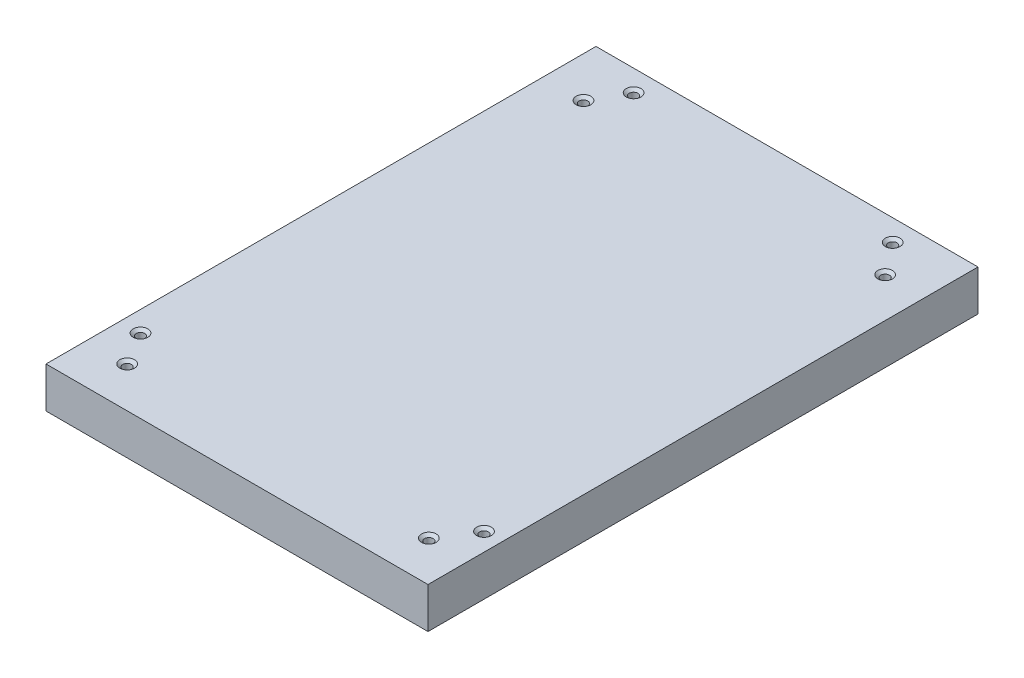
ISO-10303-21;
HEADER;
FILE_DESCRIPTION(('STEP AP214'),'2;1');
FILE_NAME('part.step','',(''),(''),'','','');
FILE_SCHEMA(('AUTOMOTIVE_DESIGN { 1 0 10303 214 1 1 1 1 }'));
ENDSEC;
DATA;
#1=APPLICATION_CONTEXT('core data for automotive mechanical design processes');
#2=APPLICATION_PROTOCOL_DEFINITION('international standard','automotive_design',2000,#1);
#3=PRODUCT_CONTEXT('',#1,'mechanical');
#4=PRODUCT('Part','Part','',(#3));
#5=PRODUCT_RELATED_PRODUCT_CATEGORY('part','',(#4));
#6=PRODUCT_DEFINITION_FORMATION('','',#4);
#7=PRODUCT_DEFINITION_CONTEXT('part definition',#1,'design');
#8=PRODUCT_DEFINITION('design','',#6,#7);
#9=PRODUCT_DEFINITION_SHAPE('','',#8);
#10=(LENGTH_UNIT() NAMED_UNIT(*) SI_UNIT(.MILLI.,.METRE.));
#11=(NAMED_UNIT(*) PLANE_ANGLE_UNIT() SI_UNIT($,.RADIAN.));
#12=(NAMED_UNIT(*) SI_UNIT($,.STERADIAN.) SOLID_ANGLE_UNIT());
#13=UNCERTAINTY_MEASURE_WITH_UNIT(LENGTH_MEASURE(1.E-05),#10,'distance_accuracy_value','');
#14=(GEOMETRIC_REPRESENTATION_CONTEXT(3) GLOBAL_UNCERTAINTY_ASSIGNED_CONTEXT((#13)) GLOBAL_UNIT_ASSIGNED_CONTEXT((#10,
#11,#12)) REPRESENTATION_CONTEXT('',''));
#15=CARTESIAN_POINT('',(0.,0.,0.));
#16=DIRECTION('',(0.,0.,1.));
#17=DIRECTION('',(1.,0.,0.));
#18=AXIS2_PLACEMENT_3D('',#15,#16,#17);
#19=CARTESIAN_POINT('',(-39.268627150472,8.382,56.5409180399653));
#20=DIRECTION('',(1.,0.,0.));
#21=DIRECTION('',(0.,0.,-1.));
#22=AXIS2_PLACEMENT_3D('',#19,#20,#21);
#23=PLANE('',#22);
#24=DIRECTION('',(0.,0.,1.));
#25=VECTOR('',#24,1.);
#26=CARTESIAN_POINT('',(-39.268627150472,0.,56.5409180399653));
#27=LINE('',#26,#25);
#28=CARTESIAN_POINT('',(-39.268627150472,0.,-56.5409180399653));
#29=VERTEX_POINT('',#28);
#30=CARTESIAN_POINT('',(-39.268627150472,0.,56.5409180399653));
#31=VERTEX_POINT('',#30);
#32=EDGE_CURVE('E100',#29,#31,#27,.T.);
#33=ORIENTED_EDGE('',*,*,#32,.T.);
#34=DIRECTION('',(0.,-1.,0.));
#35=VECTOR('',#34,1.);
#36=CARTESIAN_POINT('',(-39.268627150472,8.382,56.5409180399653));
#37=LINE('',#36,#35);
#38=CARTESIAN_POINT('',(-39.268627150472,8.382,56.5409180399653));
#39=VERTEX_POINT('',#38);
#40=EDGE_CURVE('E11',#39,#31,#37,.T.);
#41=ORIENTED_EDGE('',*,*,#40,.F.);
#42=DIRECTION('',(0.,0.,1.));
#43=VECTOR('',#42,1.);
#44=CARTESIAN_POINT('',(-39.268627150472,8.382,56.5409180399653));
#45=LINE('',#44,#43);
#46=CARTESIAN_POINT('',(-39.268627150472,8.382,-56.5409180399653));
#47=VERTEX_POINT('',#46);
#48=EDGE_CURVE('E88',#47,#39,#45,.T.);
#49=ORIENTED_EDGE('',*,*,#48,.F.);
#50=DIRECTION('',(0.,-1.,0.));
#51=VECTOR('',#50,1.);
#52=CARTESIAN_POINT('',(-39.268627150472,8.382,-56.5409180399653));
#53=LINE('',#52,#51);
#54=EDGE_CURVE('E96',#47,#29,#53,.T.);
#55=ORIENTED_EDGE('',*,*,#54,.T.);
#56=EDGE_LOOP('',(#33,#41,#49,#55));
#57=FACE_BOUND('',#56,.T.);
#58=ADVANCED_FACE('F37',(#57),#23,.F.);
#59=CARTESIAN_POINT('',(39.268627150472,8.382,56.5409180399653));
#60=DIRECTION('',(0.,0.,-1.));
#61=DIRECTION('',(-1.,0.,0.));
#62=AXIS2_PLACEMENT_3D('',#59,#60,#61);
#63=PLANE('',#62);
#64=DIRECTION('',(1.,0.,0.));
#65=VECTOR('',#64,1.);
#66=CARTESIAN_POINT('',(39.268627150472,0.,56.5409180399653));
#67=LINE('',#66,#65);
#68=CARTESIAN_POINT('',(39.268627150472,0.,56.5409180399653));
#69=VERTEX_POINT('',#68);
#70=EDGE_CURVE('E92',#31,#69,#67,.T.);
#71=ORIENTED_EDGE('',*,*,#70,.T.);
#72=DIRECTION('',(0.,-1.,0.));
#73=VECTOR('',#72,1.);
#74=CARTESIAN_POINT('',(39.268627150472,8.382,56.5409180399653));
#75=LINE('',#74,#73);
#76=CARTESIAN_POINT('',(39.268627150472,8.382,56.5409180399653));
#77=VERTEX_POINT('',#76);
#78=EDGE_CURVE('E45',#77,#69,#75,.T.);
#79=ORIENTED_EDGE('',*,*,#78,.F.);
#80=DIRECTION('',(1.,0.,0.));
#81=VECTOR('',#80,1.);
#82=CARTESIAN_POINT('',(39.268627150472,8.382,56.5409180399653));
#83=LINE('',#82,#81);
#84=EDGE_CURVE('E83',#39,#77,#83,.T.);
#85=ORIENTED_EDGE('',*,*,#84,.F.);
#86=ORIENTED_EDGE('',*,*,#40,.T.);
#87=EDGE_LOOP('',(#71,#79,#85,#86));
#88=FACE_BOUND('',#87,.T.);
#89=ADVANCED_FACE('F91',(#88),#63,.F.);
#90=CARTESIAN_POINT('',(39.268627150472,8.382,56.5409180399653));
#91=DIRECTION('',(-1.,0.,0.));
#92=DIRECTION('',(0.,0.,1.));
#93=AXIS2_PLACEMENT_3D('',#90,#91,#92);
#94=PLANE('',#93);
#95=DIRECTION('',(0.,0.,-1.));
#96=VECTOR('',#95,1.);
#97=CARTESIAN_POINT('',(39.268627150472,0.,56.5409180399653));
#98=LINE('',#97,#96);
#99=CARTESIAN_POINT('',(39.268627150472,0.,-56.5409180399653));
#100=VERTEX_POINT('',#99);
#101=EDGE_CURVE('E70',#69,#100,#98,.T.);
#102=ORIENTED_EDGE('',*,*,#101,.T.);
#103=DIRECTION('',(0.,-1.,0.));
#104=VECTOR('',#103,1.);
#105=CARTESIAN_POINT('',(39.268627150472,8.382,-56.5409180399653));
#106=LINE('',#105,#104);
#107=CARTESIAN_POINT('',(39.268627150472,8.382,-56.5409180399653));
#108=VERTEX_POINT('',#107);
#109=EDGE_CURVE('E93',#108,#100,#106,.T.);
#110=ORIENTED_EDGE('',*,*,#109,.F.);
#111=DIRECTION('',(0.,0.,-1.));
#112=VECTOR('',#111,1.);
#113=CARTESIAN_POINT('',(39.268627150472,8.382,56.5409180399653));
#114=LINE('',#113,#112);
#115=EDGE_CURVE('E86',#77,#108,#114,.T.);
#116=ORIENTED_EDGE('',*,*,#115,.F.);
#117=ORIENTED_EDGE('',*,*,#78,.T.);
#118=EDGE_LOOP('',(#102,#110,#116,#117));
#119=FACE_BOUND('',#118,.T.);
#120=ADVANCED_FACE('F94',(#119),#94,.F.);
#121=CARTESIAN_POINT('',(39.268627150472,8.382,-56.5409180399653));
#122=DIRECTION('',(0.,0.,1.));
#123=DIRECTION('',(1.,0.,0.));
#124=AXIS2_PLACEMENT_3D('',#121,#122,#123);
#125=PLANE('',#124);
#126=DIRECTION('',(-1.,0.,0.));
#127=VECTOR('',#126,1.);
#128=CARTESIAN_POINT('',(39.268627150472,0.,-56.5409180399653));
#129=LINE('',#128,#127);
#130=EDGE_CURVE('E76',#100,#29,#129,.T.);
#131=ORIENTED_EDGE('',*,*,#130,.T.);
#132=ORIENTED_EDGE('',*,*,#54,.F.);
#133=DIRECTION('',(-1.,0.,0.));
#134=VECTOR('',#133,1.);
#135=CARTESIAN_POINT('',(39.268627150472,8.382,-56.5409180399653));
#136=LINE('',#135,#134);
#137=EDGE_CURVE('E53',#108,#47,#136,.T.);
#138=ORIENTED_EDGE('',*,*,#137,.F.);
#139=ORIENTED_EDGE('',*,*,#109,.T.);
#140=EDGE_LOOP('',(#131,#132,#138,#139));
#141=FACE_BOUND('',#140,.T.);
#142=ADVANCED_FACE('F108',(#141),#125,.F.);
#143=CARTESIAN_POINT('',(0.,8.382,0.));
#144=DIRECTION('',(0.,1.,0.));
#145=DIRECTION('',(0.,0.,1.));
#146=AXIS2_PLACEMENT_3D('',#143,#144,#145);
#147=PLANE('',#146);
#148=CARTESIAN_POINT('',(-30.9288863091976,8.382,-45.6201073060665));
#149=DIRECTION('',(0.,1.,0.));
#150=DIRECTION('',(0.,0.,1.));
#151=AXIS2_PLACEMENT_3D('',#148,#149,#150);
#152=CIRCLE('',#151,1.5113);
#153=CARTESIAN_POINT('',(-30.9288863091976,8.382,-44.1088073060665));
#154=VERTEX_POINT('',#153);
#155=EDGE_CURVE('E182',#154,#154,#152,.T.);
#156=ORIENTED_EDGE('',*,*,#155,.F.);
#157=EDGE_LOOP('',(#156));
#158=FACE_BOUND('',#157,.T.);
#159=CARTESIAN_POINT('',(31.1007134553598,8.382,-45.6201073060665));
#160=DIRECTION('',(0.,1.,0.));
#161=DIRECTION('',(0.,0.,1.));
#162=AXIS2_PLACEMENT_3D('',#159,#160,#161);
#163=CIRCLE('',#162,1.5113);
#164=CARTESIAN_POINT('',(31.1007134553598,8.382,-44.1088073060665));
#165=VERTEX_POINT('',#164);
#166=EDGE_CURVE('E173',#165,#165,#163,.T.);
#167=ORIENTED_EDGE('',*,*,#166,.F.);
#168=EDGE_LOOP('',(#167));
#169=FACE_BOUND('',#168,.T.);
#170=CARTESIAN_POINT('',(31.1007134553598,8.382,48.1975144984996));
#171=DIRECTION('',(0.,1.,0.));
#172=DIRECTION('',(0.,0.,1.));
#173=AXIS2_PLACEMENT_3D('',#170,#171,#172);
#174=CIRCLE('',#173,1.5113);
#175=CARTESIAN_POINT('',(31.1007134553598,8.382,49.7088144984996));
#176=VERTEX_POINT('',#175);
#177=EDGE_CURVE('E164',#176,#176,#174,.T.);
#178=ORIENTED_EDGE('',*,*,#177,.F.);
#179=EDGE_LOOP('',(#178));
#180=FACE_BOUND('',#179,.T.);
#181=CARTESIAN_POINT('',(-30.9288863091976,8.382,48.1975144984996));
#182=DIRECTION('',(0.,1.,0.));
#183=DIRECTION('',(0.,0.,1.));
#184=AXIS2_PLACEMENT_3D('',#181,#182,#183);
#185=CIRCLE('',#184,1.5113);
#186=CARTESIAN_POINT('',(-30.9288863091976,8.382,49.7088144984996));
#187=VERTEX_POINT('',#186);
#188=EDGE_CURVE('E155',#187,#187,#185,.T.);
#189=ORIENTED_EDGE('',*,*,#188,.F.);
#190=EDGE_LOOP('',(#189));
#191=FACE_BOUND('',#190,.T.);
#192=CARTESIAN_POINT('',(-35.0527378170906,8.382,41.3244286520112));
#193=DIRECTION('',(0.,1.,0.));
#194=DIRECTION('',(0.,0.,1.));
#195=AXIS2_PLACEMENT_3D('',#192,#193,#194);
#196=CIRCLE('',#195,1.5113);
#197=CARTESIAN_POINT('',(-35.0527378170906,8.382,42.8357286520112));
#198=VERTEX_POINT('',#197);
#199=EDGE_CURVE('E146',#198,#198,#196,.T.);
#200=ORIENTED_EDGE('',*,*,#199,.F.);
#201=EDGE_LOOP('',(#200));
#202=FACE_BOUND('',#201,.T.);
#203=CARTESIAN_POINT('',(35.5682192555773,8.382,41.3244286520112));
#204=DIRECTION('',(0.,1.,0.));
#205=DIRECTION('',(0.,0.,1.));
#206=AXIS2_PLACEMENT_3D('',#203,#204,#205);
#207=CIRCLE('',#206,1.5113);
#208=CARTESIAN_POINT('',(35.5682192555773,8.382,42.8357286520112));
#209=VERTEX_POINT('',#208);
#210=EDGE_CURVE('E137',#209,#209,#207,.T.);
#211=ORIENTED_EDGE('',*,*,#210,.F.);
#212=EDGE_LOOP('',(#211));
#213=FACE_BOUND('',#212,.T.);
#214=CARTESIAN_POINT('',(26.1177262166558,8.382,-52.1495388602305));
#215=DIRECTION('',(0.,1.,0.));
#216=DIRECTION('',(0.,0.,1.));
#217=AXIS2_PLACEMENT_3D('',#214,#215,#216);
#218=CIRCLE('',#217,1.5113);
#219=CARTESIAN_POINT('',(26.1177262166558,8.382,-50.6382388602305));
#220=VERTEX_POINT('',#219);
#221=EDGE_CURVE('E128',#220,#220,#218,.T.);
#222=ORIENTED_EDGE('',*,*,#221,.F.);
#223=EDGE_LOOP('',(#222));
#224=FACE_BOUND('',#223,.T.);
#225=CARTESIAN_POINT('',(-27.148689093629,8.382,-52.1495388602305));
#226=DIRECTION('',(0.,1.,0.));
#227=DIRECTION('',(0.,0.,1.));
#228=AXIS2_PLACEMENT_3D('',#225,#226,#227);
#229=CIRCLE('',#228,1.5113);
#230=CARTESIAN_POINT('',(-27.148689093629,8.382,-50.6382388602305));
#231=VERTEX_POINT('',#230);
#232=EDGE_CURVE('E119',#231,#231,#229,.T.);
#233=ORIENTED_EDGE('',*,*,#232,.F.);
#234=EDGE_LOOP('',(#233));
#235=FACE_BOUND('',#234,.T.);
#236=ORIENTED_EDGE('',*,*,#48,.T.);
#237=ORIENTED_EDGE('',*,*,#84,.T.);
#238=ORIENTED_EDGE('',*,*,#115,.T.);
#239=ORIENTED_EDGE('',*,*,#137,.T.);
#240=EDGE_LOOP('',(#236,#237,#238,#239));
#241=FACE_BOUND('',#240,.T.);
#242=ADVANCED_FACE('F84',(#158,#169,#180,#191,#202,#213,#224,#235,#241),#147,.T.);
#243=CARTESIAN_POINT('',(0.,0.,0.));
#244=DIRECTION('',(0.,1.,0.));
#245=DIRECTION('',(0.,0.,1.));
#246=AXIS2_PLACEMENT_3D('',#243,#244,#245);
#247=PLANE('',#246);
#248=CARTESIAN_POINT('',(-30.9288863091976,0.,-45.6201073060665));
#249=DIRECTION('',(0.,1.,0.));
#250=DIRECTION('',(0.,0.,1.));
#251=AXIS2_PLACEMENT_3D('',#248,#249,#250);
#252=CIRCLE('',#251,0.888999999999997);
#253=CARTESIAN_POINT('',(-30.9288863091976,0.,-44.7311073060665));
#254=VERTEX_POINT('',#253);
#255=EDGE_CURVE('E176',#254,#254,#252,.T.);
#256=ORIENTED_EDGE('',*,*,#255,.T.);
#257=EDGE_LOOP('',(#256));
#258=FACE_BOUND('',#257,.T.);
#259=CARTESIAN_POINT('',(31.1007134553598,0.,-45.6201073060665));
#260=DIRECTION('',(0.,1.,0.));
#261=DIRECTION('',(0.,0.,1.));
#262=AXIS2_PLACEMENT_3D('',#259,#260,#261);
#263=CIRCLE('',#262,0.889000000000001);
#264=CARTESIAN_POINT('',(31.1007134553598,0.,-44.7311073060665));
#265=VERTEX_POINT('',#264);
#266=EDGE_CURVE('E167',#265,#265,#263,.T.);
#267=ORIENTED_EDGE('',*,*,#266,.T.);
#268=EDGE_LOOP('',(#267));
#269=FACE_BOUND('',#268,.T.);
#270=CARTESIAN_POINT('',(31.1007134553598,0.,48.1975144984996));
#271=DIRECTION('',(0.,1.,0.));
#272=DIRECTION('',(0.,0.,1.));
#273=AXIS2_PLACEMENT_3D('',#270,#271,#272);
#274=CIRCLE('',#273,0.889000000000001);
#275=CARTESIAN_POINT('',(31.1007134553598,0.,49.0865144984996));
#276=VERTEX_POINT('',#275);
#277=EDGE_CURVE('E158',#276,#276,#274,.T.);
#278=ORIENTED_EDGE('',*,*,#277,.T.);
#279=EDGE_LOOP('',(#278));
#280=FACE_BOUND('',#279,.T.);
#281=CARTESIAN_POINT('',(-30.9288863091976,0.,48.1975144984996));
#282=DIRECTION('',(0.,1.,0.));
#283=DIRECTION('',(0.,0.,1.));
#284=AXIS2_PLACEMENT_3D('',#281,#282,#283);
#285=CIRCLE('',#284,0.888999999999997);
#286=CARTESIAN_POINT('',(-30.9288863091976,0.,49.0865144984996));
#287=VERTEX_POINT('',#286);
#288=EDGE_CURVE('E149',#287,#287,#285,.T.);
#289=ORIENTED_EDGE('',*,*,#288,.T.);
#290=EDGE_LOOP('',(#289));
#291=FACE_BOUND('',#290,.T.);
#292=CARTESIAN_POINT('',(-35.0527378170906,0.,41.3244286520112));
#293=DIRECTION('',(0.,1.,0.));
#294=DIRECTION('',(0.,0.,1.));
#295=AXIS2_PLACEMENT_3D('',#292,#293,#294);
#296=CIRCLE('',#295,0.889000000000001);
#297=CARTESIAN_POINT('',(-35.0527378170906,0.,42.2134286520112));
#298=VERTEX_POINT('',#297);
#299=EDGE_CURVE('E140',#298,#298,#296,.T.);
#300=ORIENTED_EDGE('',*,*,#299,.T.);
#301=EDGE_LOOP('',(#300));
#302=FACE_BOUND('',#301,.T.);
#303=CARTESIAN_POINT('',(35.5682192555773,0.,41.3244286520112));
#304=DIRECTION('',(0.,1.,0.));
#305=DIRECTION('',(0.,0.,1.));
#306=AXIS2_PLACEMENT_3D('',#303,#304,#305);
#307=CIRCLE('',#306,0.889000000000001);
#308=CARTESIAN_POINT('',(35.5682192555773,0.,42.2134286520112));
#309=VERTEX_POINT('',#308);
#310=EDGE_CURVE('E131',#309,#309,#307,.T.);
#311=ORIENTED_EDGE('',*,*,#310,.T.);
#312=EDGE_LOOP('',(#311));
#313=FACE_BOUND('',#312,.T.);
#314=CARTESIAN_POINT('',(26.1177262166558,0.,-52.1495388602305));
#315=DIRECTION('',(0.,1.,0.));
#316=DIRECTION('',(0.,0.,1.));
#317=AXIS2_PLACEMENT_3D('',#314,#315,#316);
#318=CIRCLE('',#317,0.888999999999997);
#319=CARTESIAN_POINT('',(26.1177262166558,0.,-51.2605388602305));
#320=VERTEX_POINT('',#319);
#321=EDGE_CURVE('E122',#320,#320,#318,.T.);
#322=ORIENTED_EDGE('',*,*,#321,.T.);
#323=EDGE_LOOP('',(#322));
#324=FACE_BOUND('',#323,.T.);
#325=CARTESIAN_POINT('',(-27.148689093629,0.,-52.1495388602305));
#326=DIRECTION('',(0.,1.,0.));
#327=DIRECTION('',(0.,0.,1.));
#328=AXIS2_PLACEMENT_3D('',#325,#326,#327);
#329=CIRCLE('',#328,0.888999999999997);
#330=CARTESIAN_POINT('',(-27.148689093629,0.,-51.2605388602305));
#331=VERTEX_POINT('',#330);
#332=EDGE_CURVE('E103',#331,#331,#329,.T.);
#333=ORIENTED_EDGE('',*,*,#332,.T.);
#334=EDGE_LOOP('',(#333));
#335=FACE_BOUND('',#334,.T.);
#336=ORIENTED_EDGE('',*,*,#32,.F.);
#337=ORIENTED_EDGE('',*,*,#130,.F.);
#338=ORIENTED_EDGE('',*,*,#101,.F.);
#339=ORIENTED_EDGE('',*,*,#70,.F.);
#340=EDGE_LOOP('',(#336,#337,#338,#339));
#341=FACE_BOUND('',#340,.T.);
#342=ADVANCED_FACE('F111',(#258,#269,#280,#291,#302,#313,#324,#335,#341),#247,.F.);
#343=CARTESIAN_POINT('',(-27.148689093629,8.382,-52.1495388602305));
#344=DIRECTION('',(0.,1.,0.));
#345=DIRECTION('',(0.,0.,1.));
#346=AXIS2_PLACEMENT_3D('',#343,#344,#345);
#347=CYLINDRICAL_SURFACE('',#346,0.888999999999999);
#348=ORIENTED_EDGE('',*,*,#332,.F.);
#349=EDGE_LOOP('',(#348));
#350=FACE_BOUND('',#349,.T.);
#351=CARTESIAN_POINT('',(-27.148689093629,7.85982829951838,-52.1495388602305));
#352=DIRECTION('',(0.,1.,0.));
#353=DIRECTION('',(0.,0.,1.));
#354=AXIS2_PLACEMENT_3D('',#351,#352,#353);
#355=CIRCLE('',#354,0.889000000000001);
#356=CARTESIAN_POINT('',(-27.148689093629,7.85982829951838,-51.2605388602305));
#357=VERTEX_POINT('',#356);
#358=EDGE_CURVE('E116',#357,#357,#355,.T.);
#359=ORIENTED_EDGE('',*,*,#358,.T.);
#360=EDGE_LOOP('',(#359));
#361=FACE_BOUND('',#360,.T.);
#362=ADVANCED_FACE('F208',(#350,#361),#347,.F.);
#363=CARTESIAN_POINT('',(-27.148689093629,8.382,-52.1495388602305));
#364=DIRECTION('',(0.,1.,0.));
#365=DIRECTION('',(0.,0.,1.));
#366=AXIS2_PLACEMENT_3D('',#363,#364,#365);
#367=CONICAL_SURFACE('',#366,1.5113,0.872664625997165);
#368=ORIENTED_EDGE('',*,*,#358,.F.);
#369=EDGE_LOOP('',(#368));
#370=FACE_BOUND('',#369,.T.);
#371=ORIENTED_EDGE('',*,*,#232,.T.);
#372=EDGE_LOOP('',(#371));
#373=FACE_BOUND('',#372,.T.);
#374=ADVANCED_FACE('F205',(#370,#373),#367,.F.);
#375=CARTESIAN_POINT('',(26.1177262166558,8.382,-52.1495388602305));
#376=DIRECTION('',(0.,1.,0.));
#377=DIRECTION('',(0.,0.,1.));
#378=AXIS2_PLACEMENT_3D('',#375,#376,#377);
#379=CYLINDRICAL_SURFACE('',#378,0.888999999999999);
#380=ORIENTED_EDGE('',*,*,#321,.F.);
#381=EDGE_LOOP('',(#380));
#382=FACE_BOUND('',#381,.T.);
#383=CARTESIAN_POINT('',(26.1177262166558,7.85982829951838,-52.1495388602305));
#384=DIRECTION('',(0.,1.,0.));
#385=DIRECTION('',(0.,0.,1.));
#386=AXIS2_PLACEMENT_3D('',#383,#384,#385);
#387=CIRCLE('',#386,0.889000000000001);
#388=CARTESIAN_POINT('',(26.1177262166558,7.85982829951838,-51.2605388602305));
#389=VERTEX_POINT('',#388);
#390=EDGE_CURVE('E125',#389,#389,#387,.T.);
#391=ORIENTED_EDGE('',*,*,#390,.T.);
#392=EDGE_LOOP('',(#391));
#393=FACE_BOUND('',#392,.T.);
#394=ADVANCED_FACE('F207',(#382,#393),#379,.F.);
#395=CARTESIAN_POINT('',(26.1177262166558,8.382,-52.1495388602305));
#396=DIRECTION('',(0.,1.,0.));
#397=DIRECTION('',(0.,0.,1.));
#398=AXIS2_PLACEMENT_3D('',#395,#396,#397);
#399=CONICAL_SURFACE('',#398,1.5113,0.872664625997165);
#400=ORIENTED_EDGE('',*,*,#390,.F.);
#401=EDGE_LOOP('',(#400));
#402=FACE_BOUND('',#401,.T.);
#403=ORIENTED_EDGE('',*,*,#221,.T.);
#404=EDGE_LOOP('',(#403));
#405=FACE_BOUND('',#404,.T.);
#406=ADVANCED_FACE('F215',(#402,#405),#399,.F.);
#407=CARTESIAN_POINT('',(35.5682192555773,8.382,41.3244286520112));
#408=DIRECTION('',(0.,1.,0.));
#409=DIRECTION('',(0.,0.,1.));
#410=AXIS2_PLACEMENT_3D('',#407,#408,#409);
#411=CYLINDRICAL_SURFACE('',#410,0.889000000000001);
#412=ORIENTED_EDGE('',*,*,#310,.F.);
#413=EDGE_LOOP('',(#412));
#414=FACE_BOUND('',#413,.T.);
#415=CARTESIAN_POINT('',(35.5682192555773,7.85982829951838,41.3244286520112));
#416=DIRECTION('',(0.,1.,0.));
#417=DIRECTION('',(0.,0.,1.));
#418=AXIS2_PLACEMENT_3D('',#415,#416,#417);
#419=CIRCLE('',#418,0.889000000000001);
#420=CARTESIAN_POINT('',(35.5682192555773,7.85982829951838,42.2134286520112));
#421=VERTEX_POINT('',#420);
#422=EDGE_CURVE('E134',#421,#421,#419,.T.);
#423=ORIENTED_EDGE('',*,*,#422,.T.);
#424=EDGE_LOOP('',(#423));
#425=FACE_BOUND('',#424,.T.);
#426=ADVANCED_FACE('F257',(#414,#425),#411,.F.);
#427=CARTESIAN_POINT('',(35.5682192555773,8.382,41.3244286520112));
#428=DIRECTION('',(0.,1.,0.));
#429=DIRECTION('',(0.,0.,1.));
#430=AXIS2_PLACEMENT_3D('',#427,#428,#429);
#431=CONICAL_SURFACE('',#430,1.5113,0.872664625997165);
#432=ORIENTED_EDGE('',*,*,#422,.F.);
#433=EDGE_LOOP('',(#432));
#434=FACE_BOUND('',#433,.T.);
#435=ORIENTED_EDGE('',*,*,#210,.T.);
#436=EDGE_LOOP('',(#435));
#437=FACE_BOUND('',#436,.T.);
#438=ADVANCED_FACE('F262',(#434,#437),#431,.F.);
#439=CARTESIAN_POINT('',(-35.0527378170906,8.382,41.3244286520112));
#440=DIRECTION('',(0.,1.,0.));
#441=DIRECTION('',(0.,0.,1.));
#442=AXIS2_PLACEMENT_3D('',#439,#440,#441);
#443=CYLINDRICAL_SURFACE('',#442,0.889000000000001);
#444=ORIENTED_EDGE('',*,*,#299,.F.);
#445=EDGE_LOOP('',(#444));
#446=FACE_BOUND('',#445,.T.);
#447=CARTESIAN_POINT('',(-35.0527378170906,7.85982829951838,41.3244286520112));
#448=DIRECTION('',(0.,1.,0.));
#449=DIRECTION('',(0.,0.,1.));
#450=AXIS2_PLACEMENT_3D('',#447,#448,#449);
#451=CIRCLE('',#450,0.889000000000001);
#452=CARTESIAN_POINT('',(-35.0527378170906,7.85982829951838,42.2134286520112));
#453=VERTEX_POINT('',#452);
#454=EDGE_CURVE('E143',#453,#453,#451,.T.);
#455=ORIENTED_EDGE('',*,*,#454,.T.);
#456=EDGE_LOOP('',(#455));
#457=FACE_BOUND('',#456,.T.);
#458=ADVANCED_FACE('F268',(#446,#457),#443,.F.);
#459=CARTESIAN_POINT('',(-35.0527378170906,8.382,41.3244286520112));
#460=DIRECTION('',(0.,1.,0.));
#461=DIRECTION('',(0.,0.,1.));
#462=AXIS2_PLACEMENT_3D('',#459,#460,#461);
#463=CONICAL_SURFACE('',#462,1.5113,0.872664625997165);
#464=ORIENTED_EDGE('',*,*,#454,.F.);
#465=EDGE_LOOP('',(#464));
#466=FACE_BOUND('',#465,.T.);
#467=ORIENTED_EDGE('',*,*,#199,.T.);
#468=EDGE_LOOP('',(#467));
#469=FACE_BOUND('',#468,.T.);
#470=ADVANCED_FACE('F272',(#466,#469),#463,.F.);
#471=CARTESIAN_POINT('',(-30.9288863091976,8.382,48.1975144984996));
#472=DIRECTION('',(0.,1.,0.));
#473=DIRECTION('',(0.,0.,1.));
#474=AXIS2_PLACEMENT_3D('',#471,#472,#473);
#475=CYLINDRICAL_SURFACE('',#474,0.888999999999999);
#476=ORIENTED_EDGE('',*,*,#288,.F.);
#477=EDGE_LOOP('',(#476));
#478=FACE_BOUND('',#477,.T.);
#479=CARTESIAN_POINT('',(-30.9288863091976,7.85982829951838,48.1975144984996));
#480=DIRECTION('',(0.,1.,0.));
#481=DIRECTION('',(0.,0.,1.));
#482=AXIS2_PLACEMENT_3D('',#479,#480,#481);
#483=CIRCLE('',#482,0.889000000000001);
#484=CARTESIAN_POINT('',(-30.9288863091976,7.85982829951838,49.0865144984996));
#485=VERTEX_POINT('',#484);
#486=EDGE_CURVE('E152',#485,#485,#483,.T.);
#487=ORIENTED_EDGE('',*,*,#486,.T.);
#488=EDGE_LOOP('',(#487));
#489=FACE_BOUND('',#488,.T.);
#490=ADVANCED_FACE('F276',(#478,#489),#475,.F.);
#491=CARTESIAN_POINT('',(-30.9288863091976,8.382,48.1975144984996));
#492=DIRECTION('',(0.,1.,0.));
#493=DIRECTION('',(0.,0.,1.));
#494=AXIS2_PLACEMENT_3D('',#491,#492,#493);
#495=CONICAL_SURFACE('',#494,1.5113,0.872664625997165);
#496=ORIENTED_EDGE('',*,*,#486,.F.);
#497=EDGE_LOOP('',(#496));
#498=FACE_BOUND('',#497,.T.);
#499=ORIENTED_EDGE('',*,*,#188,.T.);
#500=EDGE_LOOP('',(#499));
#501=FACE_BOUND('',#500,.T.);
#502=ADVANCED_FACE('F280',(#498,#501),#495,.F.);
#503=CARTESIAN_POINT('',(31.1007134553598,8.382,48.1975144984996));
#504=DIRECTION('',(0.,1.,0.));
#505=DIRECTION('',(0.,0.,1.));
#506=AXIS2_PLACEMENT_3D('',#503,#504,#505);
#507=CYLINDRICAL_SURFACE('',#506,0.889000000000001);
#508=ORIENTED_EDGE('',*,*,#277,.F.);
#509=EDGE_LOOP('',(#508));
#510=FACE_BOUND('',#509,.T.);
#511=CARTESIAN_POINT('',(31.1007134553598,7.85982829951838,48.1975144984996));
#512=DIRECTION('',(0.,1.,0.));
#513=DIRECTION('',(0.,0.,1.));
#514=AXIS2_PLACEMENT_3D('',#511,#512,#513);
#515=CIRCLE('',#514,0.889000000000001);
#516=CARTESIAN_POINT('',(31.1007134553598,7.85982829951838,49.0865144984996));
#517=VERTEX_POINT('',#516);
#518=EDGE_CURVE('E161',#517,#517,#515,.T.);
#519=ORIENTED_EDGE('',*,*,#518,.T.);
#520=EDGE_LOOP('',(#519));
#521=FACE_BOUND('',#520,.T.);
#522=ADVANCED_FACE('F284',(#510,#521),#507,.F.);
#523=CARTESIAN_POINT('',(31.1007134553598,8.382,48.1975144984996));
#524=DIRECTION('',(0.,1.,0.));
#525=DIRECTION('',(0.,0.,1.));
#526=AXIS2_PLACEMENT_3D('',#523,#524,#525);
#527=CONICAL_SURFACE('',#526,1.5113,0.872664625997165);
#528=ORIENTED_EDGE('',*,*,#518,.F.);
#529=EDGE_LOOP('',(#528));
#530=FACE_BOUND('',#529,.T.);
#531=ORIENTED_EDGE('',*,*,#177,.T.);
#532=EDGE_LOOP('',(#531));
#533=FACE_BOUND('',#532,.T.);
#534=ADVANCED_FACE('F288',(#530,#533),#527,.F.);
#535=CARTESIAN_POINT('',(31.1007134553598,8.382,-45.6201073060665));
#536=DIRECTION('',(0.,1.,0.));
#537=DIRECTION('',(0.,0.,1.));
#538=AXIS2_PLACEMENT_3D('',#535,#536,#537);
#539=CYLINDRICAL_SURFACE('',#538,0.889000000000001);
#540=ORIENTED_EDGE('',*,*,#266,.F.);
#541=EDGE_LOOP('',(#540));
#542=FACE_BOUND('',#541,.T.);
#543=CARTESIAN_POINT('',(31.1007134553598,7.85982829951838,-45.6201073060665));
#544=DIRECTION('',(0.,1.,0.));
#545=DIRECTION('',(0.,0.,1.));
#546=AXIS2_PLACEMENT_3D('',#543,#544,#545);
#547=CIRCLE('',#546,0.889000000000001);
#548=CARTESIAN_POINT('',(31.1007134553598,7.85982829951838,-44.7311073060665));
#549=VERTEX_POINT('',#548);
#550=EDGE_CURVE('E170',#549,#549,#547,.T.);
#551=ORIENTED_EDGE('',*,*,#550,.T.);
#552=EDGE_LOOP('',(#551));
#553=FACE_BOUND('',#552,.T.);
#554=ADVANCED_FACE('F292',(#542,#553),#539,.F.);
#555=CARTESIAN_POINT('',(31.1007134553598,8.382,-45.6201073060665));
#556=DIRECTION('',(0.,1.,0.));
#557=DIRECTION('',(0.,0.,1.));
#558=AXIS2_PLACEMENT_3D('',#555,#556,#557);
#559=CONICAL_SURFACE('',#558,1.5113,0.872664625997165);
#560=ORIENTED_EDGE('',*,*,#550,.F.);
#561=EDGE_LOOP('',(#560));
#562=FACE_BOUND('',#561,.T.);
#563=ORIENTED_EDGE('',*,*,#166,.T.);
#564=EDGE_LOOP('',(#563));
#565=FACE_BOUND('',#564,.T.);
#566=ADVANCED_FACE('F296',(#562,#565),#559,.F.);
#567=CARTESIAN_POINT('',(-30.9288863091976,8.382,-45.6201073060665));
#568=DIRECTION('',(0.,1.,0.));
#569=DIRECTION('',(0.,0.,1.));
#570=AXIS2_PLACEMENT_3D('',#567,#568,#569);
#571=CYLINDRICAL_SURFACE('',#570,0.888999999999999);
#572=ORIENTED_EDGE('',*,*,#255,.F.);
#573=EDGE_LOOP('',(#572));
#574=FACE_BOUND('',#573,.T.);
#575=CARTESIAN_POINT('',(-30.9288863091976,7.85982829951838,-45.6201073060665));
#576=DIRECTION('',(0.,1.,0.));
#577=DIRECTION('',(0.,0.,1.));
#578=AXIS2_PLACEMENT_3D('',#575,#576,#577);
#579=CIRCLE('',#578,0.889000000000001);
#580=CARTESIAN_POINT('',(-30.9288863091976,7.85982829951838,-44.7311073060665));
#581=VERTEX_POINT('',#580);
#582=EDGE_CURVE('E179',#581,#581,#579,.T.);
#583=ORIENTED_EDGE('',*,*,#582,.T.);
#584=EDGE_LOOP('',(#583));
#585=FACE_BOUND('',#584,.T.);
#586=ADVANCED_FACE('F300',(#574,#585),#571,.F.);
#587=CARTESIAN_POINT('',(-30.9288863091976,8.382,-45.6201073060665));
#588=DIRECTION('',(0.,1.,0.));
#589=DIRECTION('',(0.,0.,1.));
#590=AXIS2_PLACEMENT_3D('',#587,#588,#589);
#591=CONICAL_SURFACE('',#590,1.5113,0.872664625997165);
#592=ORIENTED_EDGE('',*,*,#582,.F.);
#593=EDGE_LOOP('',(#592));
#594=FACE_BOUND('',#593,.T.);
#595=ORIENTED_EDGE('',*,*,#155,.T.);
#596=EDGE_LOOP('',(#595));
#597=FACE_BOUND('',#596,.T.);
#598=ADVANCED_FACE('F186',(#594,#597),#591,.F.);
#599=CLOSED_SHELL('',(#58,#89,#120,#142,#242,#342,#362,#374,#394,#406,#426,#438,#458,#470,#490,
#502,#522,#534,#554,#566,#586,#598));
#600=MANIFOLD_SOLID_BREP('B2',#599);
#601=ADVANCED_BREP_SHAPE_REPRESENTATION('',(#18,#600),#14);
#602=SHAPE_DEFINITION_REPRESENTATION(#9,#601);
ENDSEC;
END-ISO-10303-21;
